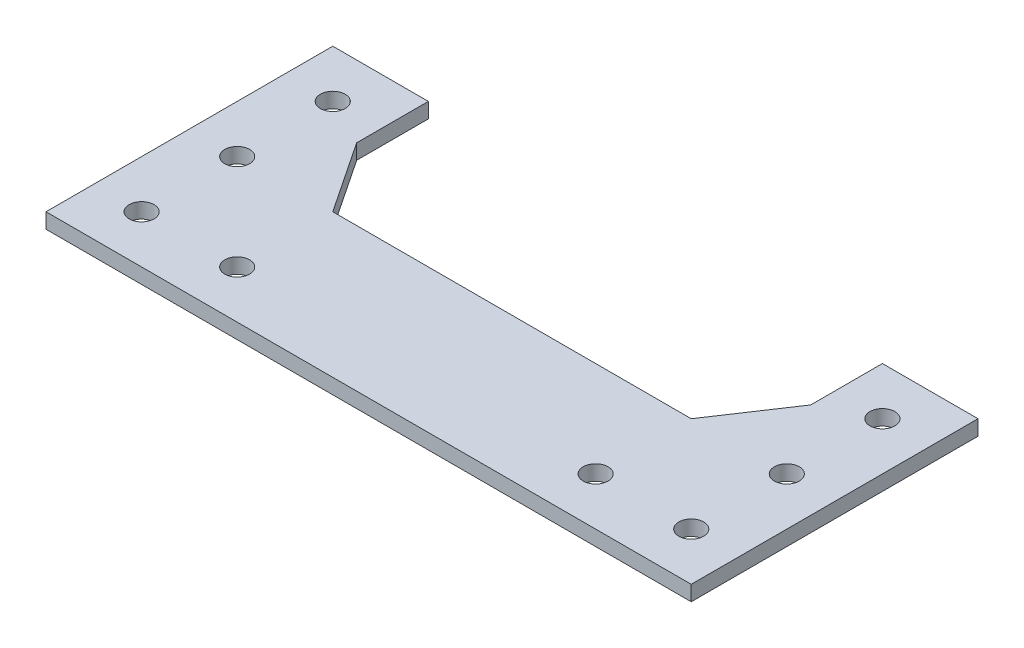
ISO-10303-21;
HEADER;
FILE_DESCRIPTION(('STEP AP214'),'2;1');
FILE_NAME('part.step','',(''),(''),'','','');
FILE_SCHEMA(('AUTOMOTIVE_DESIGN { 1 0 10303 214 1 1 1 1 }'));
ENDSEC;
DATA;
#1=APPLICATION_CONTEXT('core data for automotive mechanical design processes');
#2=APPLICATION_PROTOCOL_DEFINITION('international standard','automotive_design',2000,#1);
#3=PRODUCT_CONTEXT('',#1,'mechanical');
#4=PRODUCT('Part','Part','',(#3));
#5=PRODUCT_RELATED_PRODUCT_CATEGORY('part','',(#4));
#6=PRODUCT_DEFINITION_FORMATION('','',#4);
#7=PRODUCT_DEFINITION_CONTEXT('part definition',#1,'design');
#8=PRODUCT_DEFINITION('design','',#6,#7);
#9=PRODUCT_DEFINITION_SHAPE('','',#8);
#10=(LENGTH_UNIT() NAMED_UNIT(*) SI_UNIT(.MILLI.,.METRE.));
#11=(NAMED_UNIT(*) PLANE_ANGLE_UNIT() SI_UNIT($,.RADIAN.));
#12=(NAMED_UNIT(*) SI_UNIT($,.STERADIAN.) SOLID_ANGLE_UNIT());
#13=UNCERTAINTY_MEASURE_WITH_UNIT(LENGTH_MEASURE(1.E-05),#10,'distance_accuracy_value','');
#14=(GEOMETRIC_REPRESENTATION_CONTEXT(3) GLOBAL_UNCERTAINTY_ASSIGNED_CONTEXT((#13)) GLOBAL_UNIT_ASSIGNED_CONTEXT((#10,
#11,#12)) REPRESENTATION_CONTEXT('',''));
#15=CARTESIAN_POINT('',(0.,0.,0.));
#16=DIRECTION('',(0.,0.,1.));
#17=DIRECTION('',(1.,0.,0.));
#18=AXIS2_PLACEMENT_3D('',#15,#16,#17);
#19=CARTESIAN_POINT('',(0.,3.175,0.));
#20=DIRECTION('',(0.,1.,0.));
#21=DIRECTION('',(0.,0.,1.));
#22=AXIS2_PLACEMENT_3D('',#19,#20,#21);
#23=PLANE('',#22);
#24=CARTESIAN_POINT('',(57.5000000000001,3.175,-9.99999999999998));
#25=DIRECTION('',(0.,1.,0.));
#26=DIRECTION('',(0.,0.,-1.));
#27=AXIS2_PLACEMENT_3D('',#24,#25,#26);
#28=CIRCLE('',#27,2.59999999999999);
#29=CARTESIAN_POINT('',(57.5000000000001,3.175,-12.6));
#30=VERTEX_POINT('',#29);
#31=EDGE_CURVE('E245',#30,#30,#28,.T.);
#32=ORIENTED_EDGE('',*,*,#31,.F.);
#33=EDGE_LOOP('',(#32));
#34=FACE_BOUND('',#33,.T.);
#35=CARTESIAN_POINT('',(57.5000000000002,3.175,-50.));
#36=DIRECTION('',(0.,1.,0.));
#37=DIRECTION('',(0.,0.,-1.));
#38=AXIS2_PLACEMENT_3D('',#35,#36,#37);
#39=CIRCLE('',#38,2.59999999999999);
#40=CARTESIAN_POINT('',(57.5000000000002,3.175,-52.6));
#41=VERTEX_POINT('',#40);
#42=EDGE_CURVE('E233',#41,#41,#39,.T.);
#43=ORIENTED_EDGE('',*,*,#42,.F.);
#44=EDGE_LOOP('',(#43));
#45=FACE_BOUND('',#44,.T.);
#46=CARTESIAN_POINT('',(-57.5000000000001,3.175,-30.));
#47=DIRECTION('',(0.,1.,0.));
#48=DIRECTION('',(0.,0.,1.));
#49=AXIS2_PLACEMENT_3D('',#46,#47,#48);
#50=CIRCLE('',#49,2.59999999999999);
#51=CARTESIAN_POINT('',(-57.5000000000001,3.175,-27.4));
#52=VERTEX_POINT('',#51);
#53=EDGE_CURVE('E221',#52,#52,#50,.T.);
#54=ORIENTED_EDGE('',*,*,#53,.F.);
#55=EDGE_LOOP('',(#54));
#56=FACE_BOUND('',#55,.T.);
#57=CARTESIAN_POINT('',(-37.5000000000001,3.175,-9.99999999999998));
#58=DIRECTION('',(0.,1.,0.));
#59=DIRECTION('',(0.,0.,1.));
#60=AXIS2_PLACEMENT_3D('',#57,#58,#59);
#61=CIRCLE('',#60,2.59999999999999);
#62=CARTESIAN_POINT('',(-37.5000000000001,3.175,-7.4));
#63=VERTEX_POINT('',#62);
#64=EDGE_CURVE('E147',#63,#63,#61,.T.);
#65=ORIENTED_EDGE('',*,*,#64,.F.);
#66=EDGE_LOOP('',(#65));
#67=FACE_BOUND('',#66,.T.);
#68=DIRECTION('',(0.,0.,1.));
#69=VECTOR('',#68,1.);
#70=CARTESIAN_POINT('',(47.5000000000002,3.175,-60.));
#71=LINE('',#70,#69);
#72=CARTESIAN_POINT('',(47.5000000000002,3.175,-60.));
#73=VERTEX_POINT('',#72);
#74=CARTESIAN_POINT('',(47.5000000000002,3.175,-45.));
#75=VERTEX_POINT('',#74);
#76=EDGE_CURVE('E163',#73,#75,#71,.T.);
#77=ORIENTED_EDGE('',*,*,#76,.T.);
#78=DIRECTION('',(-0.554700196225238,0.,0.832050294337838));
#79=VECTOR('',#78,1.);
#80=CARTESIAN_POINT('',(47.5000000000002,3.175,-45.));
#81=LINE('',#80,#79);
#82=CARTESIAN_POINT('',(37.5,3.175,-30.));
#83=VERTEX_POINT('',#82);
#84=EDGE_CURVE('E100',#75,#83,#81,.T.);
#85=ORIENTED_EDGE('',*,*,#84,.T.);
#86=DIRECTION('',(-1.,0.,0.));
#87=VECTOR('',#86,1.);
#88=CARTESIAN_POINT('',(-37.5,3.175,-30.));
#89=LINE('',#88,#87);
#90=CARTESIAN_POINT('',(-37.5,3.175,-30.));
#91=VERTEX_POINT('',#90);
#92=EDGE_CURVE('E184',#83,#91,#89,.T.);
#93=ORIENTED_EDGE('',*,*,#92,.T.);
#94=DIRECTION('',(-0.554700196225238,0.,-0.832050294337838));
#95=VECTOR('',#94,1.);
#96=CARTESIAN_POINT('',(-47.5000000000002,3.175,-45.));
#97=LINE('',#96,#95);
#98=CARTESIAN_POINT('',(-47.5000000000002,3.175,-45.));
#99=VERTEX_POINT('',#98);
#100=EDGE_CURVE('E203',#91,#99,#97,.T.);
#101=ORIENTED_EDGE('',*,*,#100,.T.);
#102=DIRECTION('',(0.,0.,-1.));
#103=VECTOR('',#102,1.);
#104=CARTESIAN_POINT('',(-47.5000000000002,3.175,-60.));
#105=LINE('',#104,#103);
#106=CARTESIAN_POINT('',(-47.5000000000002,3.175,-60.));
#107=VERTEX_POINT('',#106);
#108=EDGE_CURVE('E200',#99,#107,#105,.T.);
#109=ORIENTED_EDGE('',*,*,#108,.T.);
#110=DIRECTION('',(-1.,0.,0.));
#111=VECTOR('',#110,1.);
#112=CARTESIAN_POINT('',(-67.4999999999999,3.175,-60.));
#113=LINE('',#112,#111);
#114=CARTESIAN_POINT('',(-67.4999999999999,3.175,-60.));
#115=VERTEX_POINT('',#114);
#116=EDGE_CURVE('E202',#107,#115,#113,.T.);
#117=ORIENTED_EDGE('',*,*,#116,.T.);
#118=DIRECTION('',(0.,0.,1.));
#119=VECTOR('',#118,1.);
#120=CARTESIAN_POINT('',(-67.4999999999999,3.175,0.));
#121=LINE('',#120,#119);
#122=CARTESIAN_POINT('',(-67.4999999999999,3.175,0.));
#123=VERTEX_POINT('',#122);
#124=EDGE_CURVE('E125',#115,#123,#121,.T.);
#125=ORIENTED_EDGE('',*,*,#124,.T.);
#126=DIRECTION('',(1.,0.,0.));
#127=VECTOR('',#126,1.);
#128=CARTESIAN_POINT('',(67.4999999999999,3.175,0.));
#129=LINE('',#128,#127);
#130=CARTESIAN_POINT('',(67.4999999999999,3.175,0.));
#131=VERTEX_POINT('',#130);
#132=EDGE_CURVE('E119',#123,#131,#129,.T.);
#133=ORIENTED_EDGE('',*,*,#132,.T.);
#134=DIRECTION('',(0.,0.,-1.));
#135=VECTOR('',#134,1.);
#136=CARTESIAN_POINT('',(67.4999999999999,3.175,0.));
#137=LINE('',#136,#135);
#138=CARTESIAN_POINT('',(67.4999999999999,3.175,-60.));
#139=VERTEX_POINT('',#138);
#140=EDGE_CURVE('E123',#131,#139,#137,.T.);
#141=ORIENTED_EDGE('',*,*,#140,.T.);
#142=DIRECTION('',(-1.,0.,0.));
#143=VECTOR('',#142,1.);
#144=CARTESIAN_POINT('',(67.4999999999999,3.175,-60.));
#145=LINE('',#144,#143);
#146=EDGE_CURVE('E51',#139,#73,#145,.T.);
#147=ORIENTED_EDGE('',*,*,#146,.T.);
#148=EDGE_LOOP('',(#77,#85,#93,#101,#109,#117,#125,#133,#141,#147));
#149=FACE_BOUND('',#148,.T.);
#150=CARTESIAN_POINT('',(-57.5000000000001,3.175,-9.99999999999998));
#151=DIRECTION('',(0.,1.,0.));
#152=DIRECTION('',(0.,0.,1.));
#153=AXIS2_PLACEMENT_3D('',#150,#151,#152);
#154=CIRCLE('',#153,2.59999999999999);
#155=CARTESIAN_POINT('',(-57.5000000000001,3.175,-7.4));
#156=VERTEX_POINT('',#155);
#157=EDGE_CURVE('E215',#156,#156,#154,.T.);
#158=ORIENTED_EDGE('',*,*,#157,.F.);
#159=EDGE_LOOP('',(#158));
#160=FACE_BOUND('',#159,.T.);
#161=CARTESIAN_POINT('',(-57.5000000000002,3.175,-50.));
#162=DIRECTION('',(0.,1.,0.));
#163=DIRECTION('',(0.,0.,1.));
#164=AXIS2_PLACEMENT_3D('',#161,#162,#163);
#165=CIRCLE('',#164,2.59999999999999);
#166=CARTESIAN_POINT('',(-57.5000000000002,3.175,-47.4));
#167=VERTEX_POINT('',#166);
#168=EDGE_CURVE('E227',#167,#167,#165,.T.);
#169=ORIENTED_EDGE('',*,*,#168,.F.);
#170=EDGE_LOOP('',(#169));
#171=FACE_BOUND('',#170,.T.);
#172=CARTESIAN_POINT('',(57.5000000000001,3.175,-30.));
#173=DIRECTION('',(0.,1.,0.));
#174=DIRECTION('',(0.,0.,-1.));
#175=AXIS2_PLACEMENT_3D('',#172,#173,#174);
#176=CIRCLE('',#175,2.59999999999999);
#177=CARTESIAN_POINT('',(57.5000000000001,3.175,-32.6));
#178=VERTEX_POINT('',#177);
#179=EDGE_CURVE('E239',#178,#178,#176,.T.);
#180=ORIENTED_EDGE('',*,*,#179,.F.);
#181=EDGE_LOOP('',(#180));
#182=FACE_BOUND('',#181,.T.);
#183=CARTESIAN_POINT('',(37.5000000000001,3.175,-9.99999999999998));
#184=DIRECTION('',(0.,1.,0.));
#185=DIRECTION('',(0.,0.,-1.));
#186=AXIS2_PLACEMENT_3D('',#183,#184,#185);
#187=CIRCLE('',#186,2.59999999999999);
#188=CARTESIAN_POINT('',(37.5000000000001,3.175,-12.6));
#189=VERTEX_POINT('',#188);
#190=EDGE_CURVE('E251',#189,#189,#187,.T.);
#191=ORIENTED_EDGE('',*,*,#190,.F.);
#192=EDGE_LOOP('',(#191));
#193=FACE_BOUND('',#192,.T.);
#194=ADVANCED_FACE('F34',(#34,#45,#56,#67,#149,#160,#171,#182,#193),#23,.T.);
#195=CARTESIAN_POINT('',(0.,0.,0.));
#196=DIRECTION('',(0.,1.,0.));
#197=DIRECTION('',(0.,0.,1.));
#198=AXIS2_PLACEMENT_3D('',#195,#196,#197);
#199=PLANE('',#198);
#200=CARTESIAN_POINT('',(57.5000000000001,0.,-9.99999999999998));
#201=DIRECTION('',(0.,1.,0.));
#202=DIRECTION('',(0.,0.,-1.));
#203=AXIS2_PLACEMENT_3D('',#200,#201,#202);
#204=CIRCLE('',#203,2.59999999999999);
#205=CARTESIAN_POINT('',(57.5000000000001,0.,-12.6));
#206=VERTEX_POINT('',#205);
#207=EDGE_CURVE('E248',#206,#206,#204,.T.);
#208=ORIENTED_EDGE('',*,*,#207,.T.);
#209=EDGE_LOOP('',(#208));
#210=FACE_BOUND('',#209,.T.);
#211=CARTESIAN_POINT('',(57.5000000000002,0.,-50.));
#212=DIRECTION('',(0.,1.,0.));
#213=DIRECTION('',(0.,0.,-1.));
#214=AXIS2_PLACEMENT_3D('',#211,#212,#213);
#215=CIRCLE('',#214,2.59999999999999);
#216=CARTESIAN_POINT('',(57.5000000000002,0.,-52.6));
#217=VERTEX_POINT('',#216);
#218=EDGE_CURVE('E236',#217,#217,#215,.T.);
#219=ORIENTED_EDGE('',*,*,#218,.T.);
#220=EDGE_LOOP('',(#219));
#221=FACE_BOUND('',#220,.T.);
#222=CARTESIAN_POINT('',(-57.5000000000001,0.,-30.));
#223=DIRECTION('',(0.,1.,0.));
#224=DIRECTION('',(0.,0.,1.));
#225=AXIS2_PLACEMENT_3D('',#222,#223,#224);
#226=CIRCLE('',#225,2.59999999999999);
#227=CARTESIAN_POINT('',(-57.5000000000001,0.,-27.4));
#228=VERTEX_POINT('',#227);
#229=EDGE_CURVE('E224',#228,#228,#226,.T.);
#230=ORIENTED_EDGE('',*,*,#229,.T.);
#231=EDGE_LOOP('',(#230));
#232=FACE_BOUND('',#231,.T.);
#233=CARTESIAN_POINT('',(-37.5000000000001,0.,-9.99999999999998));
#234=DIRECTION('',(0.,1.,0.));
#235=DIRECTION('',(0.,0.,1.));
#236=AXIS2_PLACEMENT_3D('',#233,#234,#235);
#237=CIRCLE('',#236,2.59999999999999);
#238=CARTESIAN_POINT('',(-37.5000000000001,0.,-7.4));
#239=VERTEX_POINT('',#238);
#240=EDGE_CURVE('E212',#239,#239,#237,.T.);
#241=ORIENTED_EDGE('',*,*,#240,.T.);
#242=EDGE_LOOP('',(#241));
#243=FACE_BOUND('',#242,.T.);
#244=DIRECTION('',(0.,0.,1.));
#245=VECTOR('',#244,1.);
#246=CARTESIAN_POINT('',(47.5000000000002,0.,-60.));
#247=LINE('',#246,#245);
#248=CARTESIAN_POINT('',(47.5000000000002,0.,-60.));
#249=VERTEX_POINT('',#248);
#250=CARTESIAN_POINT('',(47.5000000000002,0.,-45.));
#251=VERTEX_POINT('',#250);
#252=EDGE_CURVE('E143',#249,#251,#247,.T.);
#253=ORIENTED_EDGE('',*,*,#252,.F.);
#254=DIRECTION('',(-1.,0.,0.));
#255=VECTOR('',#254,1.);
#256=CARTESIAN_POINT('',(67.4999999999999,0.,-60.));
#257=LINE('',#256,#255);
#258=CARTESIAN_POINT('',(67.4999999999999,0.,-60.));
#259=VERTEX_POINT('',#258);
#260=EDGE_CURVE('E92',#259,#249,#257,.T.);
#261=ORIENTED_EDGE('',*,*,#260,.F.);
#262=DIRECTION('',(0.,0.,-1.));
#263=VECTOR('',#262,1.);
#264=CARTESIAN_POINT('',(67.4999999999999,0.,0.));
#265=LINE('',#264,#263);
#266=CARTESIAN_POINT('',(67.4999999999999,0.,0.));
#267=VERTEX_POINT('',#266);
#268=EDGE_CURVE('E86',#267,#259,#265,.T.);
#269=ORIENTED_EDGE('',*,*,#268,.F.);
#270=DIRECTION('',(1.,0.,0.));
#271=VECTOR('',#270,1.);
#272=CARTESIAN_POINT('',(67.4999999999999,0.,0.));
#273=LINE('',#272,#271);
#274=CARTESIAN_POINT('',(-67.4999999999999,0.,0.));
#275=VERTEX_POINT('',#274);
#276=EDGE_CURVE('E133',#275,#267,#273,.T.);
#277=ORIENTED_EDGE('',*,*,#276,.F.);
#278=DIRECTION('',(0.,0.,1.));
#279=VECTOR('',#278,1.);
#280=CARTESIAN_POINT('',(-67.4999999999999,0.,0.));
#281=LINE('',#280,#279);
#282=CARTESIAN_POINT('',(-67.4999999999999,0.,-60.));
#283=VERTEX_POINT('',#282);
#284=EDGE_CURVE('E158',#283,#275,#281,.T.);
#285=ORIENTED_EDGE('',*,*,#284,.F.);
#286=DIRECTION('',(-1.,0.,0.));
#287=VECTOR('',#286,1.);
#288=CARTESIAN_POINT('',(-67.4999999999999,0.,-60.));
#289=LINE('',#288,#287);
#290=CARTESIAN_POINT('',(-47.5000000000002,0.,-60.));
#291=VERTEX_POINT('',#290);
#292=EDGE_CURVE('E155',#291,#283,#289,.T.);
#293=ORIENTED_EDGE('',*,*,#292,.F.);
#294=DIRECTION('',(0.,0.,-1.));
#295=VECTOR('',#294,1.);
#296=CARTESIAN_POINT('',(-47.5000000000002,0.,-60.));
#297=LINE('',#296,#295);
#298=CARTESIAN_POINT('',(-47.5000000000002,0.,-45.));
#299=VERTEX_POINT('',#298);
#300=EDGE_CURVE('E153',#299,#291,#297,.T.);
#301=ORIENTED_EDGE('',*,*,#300,.F.);
#302=DIRECTION('',(-0.554700196225238,0.,-0.832050294337838));
#303=VECTOR('',#302,1.);
#304=CARTESIAN_POINT('',(-47.5000000000002,0.,-45.));
#305=LINE('',#304,#303);
#306=CARTESIAN_POINT('',(-37.5,0.,-30.));
#307=VERTEX_POINT('',#306);
#308=EDGE_CURVE('E151',#307,#299,#305,.T.);
#309=ORIENTED_EDGE('',*,*,#308,.F.);
#310=DIRECTION('',(-1.,0.,0.));
#311=VECTOR('',#310,1.);
#312=CARTESIAN_POINT('',(-37.5,0.,-30.));
#313=LINE('',#312,#311);
#314=CARTESIAN_POINT('',(37.5,0.,-30.));
#315=VERTEX_POINT('',#314);
#316=EDGE_CURVE('E149',#315,#307,#313,.T.);
#317=ORIENTED_EDGE('',*,*,#316,.F.);
#318=DIRECTION('',(-0.554700196225238,0.,0.832050294337838));
#319=VECTOR('',#318,1.);
#320=CARTESIAN_POINT('',(47.5000000000002,0.,-45.));
#321=LINE('',#320,#319);
#322=EDGE_CURVE('E146',#251,#315,#321,.T.);
#323=ORIENTED_EDGE('',*,*,#322,.F.);
#324=EDGE_LOOP('',(#253,#261,#269,#277,#285,#293,#301,#309,#317,#323));
#325=FACE_BOUND('',#324,.T.);
#326=CARTESIAN_POINT('',(-57.5000000000001,0.,-9.99999999999998));
#327=DIRECTION('',(0.,1.,0.));
#328=DIRECTION('',(0.,0.,1.));
#329=AXIS2_PLACEMENT_3D('',#326,#327,#328);
#330=CIRCLE('',#329,2.59999999999999);
#331=CARTESIAN_POINT('',(-57.5000000000001,0.,-7.4));
#332=VERTEX_POINT('',#331);
#333=EDGE_CURVE('E218',#332,#332,#330,.T.);
#334=ORIENTED_EDGE('',*,*,#333,.T.);
#335=EDGE_LOOP('',(#334));
#336=FACE_BOUND('',#335,.T.);
#337=CARTESIAN_POINT('',(-57.5000000000002,0.,-50.));
#338=DIRECTION('',(0.,1.,0.));
#339=DIRECTION('',(0.,0.,1.));
#340=AXIS2_PLACEMENT_3D('',#337,#338,#339);
#341=CIRCLE('',#340,2.59999999999999);
#342=CARTESIAN_POINT('',(-57.5000000000002,0.,-47.4));
#343=VERTEX_POINT('',#342);
#344=EDGE_CURVE('E230',#343,#343,#341,.T.);
#345=ORIENTED_EDGE('',*,*,#344,.T.);
#346=EDGE_LOOP('',(#345));
#347=FACE_BOUND('',#346,.T.);
#348=CARTESIAN_POINT('',(57.5000000000001,0.,-30.));
#349=DIRECTION('',(0.,1.,0.));
#350=DIRECTION('',(0.,0.,-1.));
#351=AXIS2_PLACEMENT_3D('',#348,#349,#350);
#352=CIRCLE('',#351,2.59999999999999);
#353=CARTESIAN_POINT('',(57.5000000000001,0.,-32.6));
#354=VERTEX_POINT('',#353);
#355=EDGE_CURVE('E242',#354,#354,#352,.T.);
#356=ORIENTED_EDGE('',*,*,#355,.T.);
#357=EDGE_LOOP('',(#356));
#358=FACE_BOUND('',#357,.T.);
#359=CARTESIAN_POINT('',(37.5000000000001,0.,-9.99999999999998));
#360=DIRECTION('',(0.,1.,0.));
#361=DIRECTION('',(0.,0.,-1.));
#362=AXIS2_PLACEMENT_3D('',#359,#360,#361);
#363=CIRCLE('',#362,2.59999999999999);
#364=CARTESIAN_POINT('',(37.5000000000001,0.,-12.6));
#365=VERTEX_POINT('',#364);
#366=EDGE_CURVE('E254',#365,#365,#363,.T.);
#367=ORIENTED_EDGE('',*,*,#366,.T.);
#368=EDGE_LOOP('',(#367));
#369=FACE_BOUND('',#368,.T.);
#370=ADVANCED_FACE('F188',(#210,#221,#232,#243,#325,#336,#347,#358,#369),#199,.F.);
#371=CARTESIAN_POINT('',(47.5000000000002,3.175,-60.));
#372=DIRECTION('',(1.,0.,0.));
#373=DIRECTION('',(0.,0.,-1.));
#374=AXIS2_PLACEMENT_3D('',#371,#372,#373);
#375=PLANE('',#374);
#376=ORIENTED_EDGE('',*,*,#252,.T.);
#377=DIRECTION('',(0.,-1.,0.));
#378=VECTOR('',#377,1.);
#379=CARTESIAN_POINT('',(47.5000000000002,3.175,-45.));
#380=LINE('',#379,#378);
#381=EDGE_CURVE('E11',#75,#251,#380,.T.);
#382=ORIENTED_EDGE('',*,*,#381,.F.);
#383=ORIENTED_EDGE('',*,*,#76,.F.);
#384=DIRECTION('',(0.,-1.,0.));
#385=VECTOR('',#384,1.);
#386=CARTESIAN_POINT('',(47.5000000000002,3.175,-60.));
#387=LINE('',#386,#385);
#388=EDGE_CURVE('E139',#73,#249,#387,.T.);
#389=ORIENTED_EDGE('',*,*,#388,.T.);
#390=EDGE_LOOP('',(#376,#382,#383,#389));
#391=FACE_BOUND('',#390,.T.);
#392=ADVANCED_FACE('F36',(#391),#375,.F.);
#393=CARTESIAN_POINT('',(47.5000000000002,3.175,-45.));
#394=DIRECTION('',(0.832050294337838,0.,0.554700196225238));
#395=DIRECTION('',(0.554700196225238,0.,-0.832050294337838));
#396=AXIS2_PLACEMENT_3D('',#393,#394,#395);
#397=PLANE('',#396);
#398=ORIENTED_EDGE('',*,*,#322,.T.);
#399=DIRECTION('',(0.,-1.,0.));
#400=VECTOR('',#399,1.);
#401=CARTESIAN_POINT('',(37.5,3.175,-30.));
#402=LINE('',#401,#400);
#403=EDGE_CURVE('E43',#83,#315,#402,.T.);
#404=ORIENTED_EDGE('',*,*,#403,.F.);
#405=ORIENTED_EDGE('',*,*,#84,.F.);
#406=ORIENTED_EDGE('',*,*,#381,.T.);
#407=EDGE_LOOP('',(#398,#404,#405,#406));
#408=FACE_BOUND('',#407,.T.);
#409=ADVANCED_FACE('F297',(#408),#397,.F.);
#410=CARTESIAN_POINT('',(-37.5,3.175,-30.));
#411=DIRECTION('',(0.,0.,1.));
#412=DIRECTION('',(1.,0.,0.));
#413=AXIS2_PLACEMENT_3D('',#410,#411,#412);
#414=PLANE('',#413);
#415=ORIENTED_EDGE('',*,*,#316,.T.);
#416=DIRECTION('',(0.,-1.,0.));
#417=VECTOR('',#416,1.);
#418=CARTESIAN_POINT('',(-37.5,3.175,-30.));
#419=LINE('',#418,#417);
#420=EDGE_CURVE('E176',#91,#307,#419,.T.);
#421=ORIENTED_EDGE('',*,*,#420,.F.);
#422=ORIENTED_EDGE('',*,*,#92,.F.);
#423=ORIENTED_EDGE('',*,*,#403,.T.);
#424=EDGE_LOOP('',(#415,#421,#422,#423));
#425=FACE_BOUND('',#424,.T.);
#426=ADVANCED_FACE('F182',(#425),#414,.F.);
#427=CARTESIAN_POINT('',(-47.5000000000002,3.175,-45.));
#428=DIRECTION('',(-0.832050294337838,0.,0.554700196225238));
#429=DIRECTION('',(0.554700196225238,0.,0.832050294337838));
#430=AXIS2_PLACEMENT_3D('',#427,#428,#429);
#431=PLANE('',#430);
#432=ORIENTED_EDGE('',*,*,#308,.T.);
#433=DIRECTION('',(0.,-1.,0.));
#434=VECTOR('',#433,1.);
#435=CARTESIAN_POINT('',(-47.5000000000002,3.175,-45.));
#436=LINE('',#435,#434);
#437=EDGE_CURVE('E173',#99,#299,#436,.T.);
#438=ORIENTED_EDGE('',*,*,#437,.F.);
#439=ORIENTED_EDGE('',*,*,#100,.F.);
#440=ORIENTED_EDGE('',*,*,#420,.T.);
#441=EDGE_LOOP('',(#432,#438,#439,#440));
#442=FACE_BOUND('',#441,.T.);
#443=ADVANCED_FACE('F194',(#442),#431,.F.);
#444=CARTESIAN_POINT('',(-47.5000000000002,3.175,-60.));
#445=DIRECTION('',(-1.,0.,0.));
#446=DIRECTION('',(0.,0.,1.));
#447=AXIS2_PLACEMENT_3D('',#444,#445,#446);
#448=PLANE('',#447);
#449=ORIENTED_EDGE('',*,*,#300,.T.);
#450=DIRECTION('',(0.,-1.,0.));
#451=VECTOR('',#450,1.);
#452=CARTESIAN_POINT('',(-47.5000000000002,3.175,-60.));
#453=LINE('',#452,#451);
#454=EDGE_CURVE('E170',#107,#291,#453,.T.);
#455=ORIENTED_EDGE('',*,*,#454,.F.);
#456=ORIENTED_EDGE('',*,*,#108,.F.);
#457=ORIENTED_EDGE('',*,*,#437,.T.);
#458=EDGE_LOOP('',(#449,#455,#456,#457));
#459=FACE_BOUND('',#458,.T.);
#460=ADVANCED_FACE('F198',(#459),#448,.F.);
#461=CARTESIAN_POINT('',(-67.4999999999999,3.175,-60.));
#462=DIRECTION('',(0.,0.,1.));
#463=DIRECTION('',(1.,0.,0.));
#464=AXIS2_PLACEMENT_3D('',#461,#462,#463);
#465=PLANE('',#464);
#466=ORIENTED_EDGE('',*,*,#292,.T.);
#467=DIRECTION('',(0.,-1.,0.));
#468=VECTOR('',#467,1.);
#469=CARTESIAN_POINT('',(-67.4999999999999,3.175,-60.));
#470=LINE('',#469,#468);
#471=EDGE_CURVE('E167',#115,#283,#470,.T.);
#472=ORIENTED_EDGE('',*,*,#471,.F.);
#473=ORIENTED_EDGE('',*,*,#116,.F.);
#474=ORIENTED_EDGE('',*,*,#454,.T.);
#475=EDGE_LOOP('',(#466,#472,#473,#474));
#476=FACE_BOUND('',#475,.T.);
#477=ADVANCED_FACE('F287',(#476),#465,.F.);
#478=CARTESIAN_POINT('',(-67.4999999999999,3.175,0.));
#479=DIRECTION('',(1.,0.,0.));
#480=DIRECTION('',(0.,0.,-1.));
#481=AXIS2_PLACEMENT_3D('',#478,#479,#480);
#482=PLANE('',#481);
#483=ORIENTED_EDGE('',*,*,#284,.T.);
#484=DIRECTION('',(0.,-1.,0.));
#485=VECTOR('',#484,1.);
#486=CARTESIAN_POINT('',(-67.4999999999999,3.175,0.));
#487=LINE('',#486,#485);
#488=EDGE_CURVE('E134',#123,#275,#487,.T.);
#489=ORIENTED_EDGE('',*,*,#488,.F.);
#490=ORIENTED_EDGE('',*,*,#124,.F.);
#491=ORIENTED_EDGE('',*,*,#471,.T.);
#492=EDGE_LOOP('',(#483,#489,#490,#491));
#493=FACE_BOUND('',#492,.T.);
#494=ADVANCED_FACE('F284',(#493),#482,.F.);
#495=CARTESIAN_POINT('',(67.4999999999999,3.175,0.));
#496=DIRECTION('',(0.,0.,-1.));
#497=DIRECTION('',(-1.,0.,0.));
#498=AXIS2_PLACEMENT_3D('',#495,#496,#497);
#499=PLANE('',#498);
#500=ORIENTED_EDGE('',*,*,#276,.T.);
#501=DIRECTION('',(0.,-1.,0.));
#502=VECTOR('',#501,1.);
#503=CARTESIAN_POINT('',(67.4999999999999,3.175,0.));
#504=LINE('',#503,#502);
#505=EDGE_CURVE('E130',#131,#267,#504,.T.);
#506=ORIENTED_EDGE('',*,*,#505,.F.);
#507=ORIENTED_EDGE('',*,*,#132,.F.);
#508=ORIENTED_EDGE('',*,*,#488,.T.);
#509=EDGE_LOOP('',(#500,#506,#507,#508));
#510=FACE_BOUND('',#509,.T.);
#511=ADVANCED_FACE('F131',(#510),#499,.F.);
#512=CARTESIAN_POINT('',(67.4999999999999,3.175,0.));
#513=DIRECTION('',(-1.,0.,0.));
#514=DIRECTION('',(0.,0.,1.));
#515=AXIS2_PLACEMENT_3D('',#512,#513,#514);
#516=PLANE('',#515);
#517=ORIENTED_EDGE('',*,*,#268,.T.);
#518=DIRECTION('',(0.,-1.,0.));
#519=VECTOR('',#518,1.);
#520=CARTESIAN_POINT('',(67.4999999999999,3.175,-60.));
#521=LINE('',#520,#519);
#522=EDGE_CURVE('E135',#139,#259,#521,.T.);
#523=ORIENTED_EDGE('',*,*,#522,.F.);
#524=ORIENTED_EDGE('',*,*,#140,.F.);
#525=ORIENTED_EDGE('',*,*,#505,.T.);
#526=EDGE_LOOP('',(#517,#523,#524,#525));
#527=FACE_BOUND('',#526,.T.);
#528=ADVANCED_FACE('F137',(#527),#516,.F.);
#529=CARTESIAN_POINT('',(67.4999999999999,3.175,-60.));
#530=DIRECTION('',(0.,0.,1.));
#531=DIRECTION('',(1.,0.,0.));
#532=AXIS2_PLACEMENT_3D('',#529,#530,#531);
#533=PLANE('',#532);
#534=ORIENTED_EDGE('',*,*,#260,.T.);
#535=ORIENTED_EDGE('',*,*,#388,.F.);
#536=ORIENTED_EDGE('',*,*,#146,.F.);
#537=ORIENTED_EDGE('',*,*,#522,.T.);
#538=EDGE_LOOP('',(#534,#535,#536,#537));
#539=FACE_BOUND('',#538,.T.);
#540=ADVANCED_FACE('F277',(#539),#533,.F.);
#541=CARTESIAN_POINT('',(-37.5000000000001,3.175,-9.99999999999998));
#542=DIRECTION('',(0.,-1.,0.));
#543=DIRECTION('',(0.,0.,-1.));
#544=AXIS2_PLACEMENT_3D('',#541,#542,#543);
#545=CYLINDRICAL_SURFACE('',#544,2.59999999999999);
#546=ORIENTED_EDGE('',*,*,#64,.T.);
#547=EDGE_LOOP('',(#546));
#548=FACE_BOUND('',#547,.T.);
#549=ORIENTED_EDGE('',*,*,#240,.F.);
#550=EDGE_LOOP('',(#549));
#551=FACE_BOUND('',#550,.T.);
#552=ADVANCED_FACE('F274',(#548,#551),#545,.F.);
#553=CARTESIAN_POINT('',(-57.5000000000001,3.175,-9.99999999999998));
#554=DIRECTION('',(0.,-1.,0.));
#555=DIRECTION('',(0.,0.,-1.));
#556=AXIS2_PLACEMENT_3D('',#553,#554,#555);
#557=CYLINDRICAL_SURFACE('',#556,2.59999999999999);
#558=ORIENTED_EDGE('',*,*,#157,.T.);
#559=EDGE_LOOP('',(#558));
#560=FACE_BOUND('',#559,.T.);
#561=ORIENTED_EDGE('',*,*,#333,.F.);
#562=EDGE_LOOP('',(#561));
#563=FACE_BOUND('',#562,.T.);
#564=ADVANCED_FACE('F374',(#560,#563),#557,.F.);
#565=CARTESIAN_POINT('',(-57.5000000000001,3.175,-30.));
#566=DIRECTION('',(0.,-1.,0.));
#567=DIRECTION('',(0.,0.,-1.));
#568=AXIS2_PLACEMENT_3D('',#565,#566,#567);
#569=CYLINDRICAL_SURFACE('',#568,2.59999999999999);
#570=ORIENTED_EDGE('',*,*,#53,.T.);
#571=EDGE_LOOP('',(#570));
#572=FACE_BOUND('',#571,.T.);
#573=ORIENTED_EDGE('',*,*,#229,.F.);
#574=EDGE_LOOP('',(#573));
#575=FACE_BOUND('',#574,.T.);
#576=ADVANCED_FACE('F382',(#572,#575),#569,.F.);
#577=CARTESIAN_POINT('',(-57.5000000000002,3.175,-50.));
#578=DIRECTION('',(0.,-1.,0.));
#579=DIRECTION('',(0.,0.,-1.));
#580=AXIS2_PLACEMENT_3D('',#577,#578,#579);
#581=CYLINDRICAL_SURFACE('',#580,2.59999999999999);
#582=ORIENTED_EDGE('',*,*,#168,.T.);
#583=EDGE_LOOP('',(#582));
#584=FACE_BOUND('',#583,.T.);
#585=ORIENTED_EDGE('',*,*,#344,.F.);
#586=EDGE_LOOP('',(#585));
#587=FACE_BOUND('',#586,.T.);
#588=ADVANCED_FACE('F390',(#584,#587),#581,.F.);
#589=CARTESIAN_POINT('',(57.5000000000002,3.175,-50.));
#590=DIRECTION('',(0.,-1.,0.));
#591=DIRECTION('',(0.,0.,-1.));
#592=AXIS2_PLACEMENT_3D('',#589,#590,#591);
#593=CYLINDRICAL_SURFACE('',#592,2.59999999999999);
#594=ORIENTED_EDGE('',*,*,#42,.T.);
#595=EDGE_LOOP('',(#594));
#596=FACE_BOUND('',#595,.T.);
#597=ORIENTED_EDGE('',*,*,#218,.F.);
#598=EDGE_LOOP('',(#597));
#599=FACE_BOUND('',#598,.T.);
#600=ADVANCED_FACE('F399',(#596,#599),#593,.F.);
#601=CARTESIAN_POINT('',(57.5000000000001,3.175,-30.));
#602=DIRECTION('',(0.,-1.,0.));
#603=DIRECTION('',(0.,0.,-1.));
#604=AXIS2_PLACEMENT_3D('',#601,#602,#603);
#605=CYLINDRICAL_SURFACE('',#604,2.59999999999999);
#606=ORIENTED_EDGE('',*,*,#179,.T.);
#607=EDGE_LOOP('',(#606));
#608=FACE_BOUND('',#607,.T.);
#609=ORIENTED_EDGE('',*,*,#355,.F.);
#610=EDGE_LOOP('',(#609));
#611=FACE_BOUND('',#610,.T.);
#612=ADVANCED_FACE('F408',(#608,#611),#605,.F.);
#613=CARTESIAN_POINT('',(57.5000000000001,3.175,-9.99999999999998));
#614=DIRECTION('',(0.,-1.,0.));
#615=DIRECTION('',(0.,0.,-1.));
#616=AXIS2_PLACEMENT_3D('',#613,#614,#615);
#617=CYLINDRICAL_SURFACE('',#616,2.59999999999999);
#618=ORIENTED_EDGE('',*,*,#31,.T.);
#619=EDGE_LOOP('',(#618));
#620=FACE_BOUND('',#619,.T.);
#621=ORIENTED_EDGE('',*,*,#207,.F.);
#622=EDGE_LOOP('',(#621));
#623=FACE_BOUND('',#622,.T.);
#624=ADVANCED_FACE('F417',(#620,#623),#617,.F.);
#625=CARTESIAN_POINT('',(37.5000000000001,3.175,-9.99999999999998));
#626=DIRECTION('',(0.,-1.,0.));
#627=DIRECTION('',(0.,0.,-1.));
#628=AXIS2_PLACEMENT_3D('',#625,#626,#627);
#629=CYLINDRICAL_SURFACE('',#628,2.59999999999999);
#630=ORIENTED_EDGE('',*,*,#190,.T.);
#631=EDGE_LOOP('',(#630));
#632=FACE_BOUND('',#631,.T.);
#633=ORIENTED_EDGE('',*,*,#366,.F.);
#634=EDGE_LOOP('',(#633));
#635=FACE_BOUND('',#634,.T.);
#636=ADVANCED_FACE('F260',(#632,#635),#629,.F.);
#637=CLOSED_SHELL('',(#194,#370,#392,#409,#426,#443,#460,#477,#494,#511,#528,#540,#552,#564,
#576,#588,#600,#612,#624,#636));
#638=MANIFOLD_SOLID_BREP('B2',#637);
#639=ADVANCED_BREP_SHAPE_REPRESENTATION('',(#18,#638),#14);
#640=SHAPE_DEFINITION_REPRESENTATION(#9,#639);
ENDSEC;
END-ISO-10303-21;
